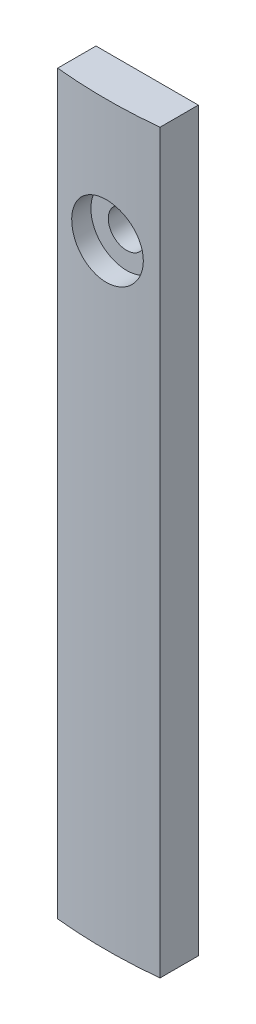
ISO-10303-21;
HEADER;
FILE_DESCRIPTION(('STEP AP214'),'2;1');
FILE_NAME('part.step','',(''),(''),'','','');
FILE_SCHEMA(('AUTOMOTIVE_DESIGN { 1 0 10303 214 1 1 1 1 }'));
ENDSEC;
DATA;
#1=APPLICATION_CONTEXT('core data for automotive mechanical design processes');
#2=APPLICATION_PROTOCOL_DEFINITION('international standard','automotive_design',2000,#1);
#3=PRODUCT_CONTEXT('',#1,'mechanical');
#4=PRODUCT('Part','Part','',(#3));
#5=PRODUCT_RELATED_PRODUCT_CATEGORY('part','',(#4));
#6=PRODUCT_DEFINITION_FORMATION('','',#4);
#7=PRODUCT_DEFINITION_CONTEXT('part definition',#1,'design');
#8=PRODUCT_DEFINITION('design','',#6,#7);
#9=PRODUCT_DEFINITION_SHAPE('','',#8);
#10=(LENGTH_UNIT() NAMED_UNIT(*) SI_UNIT(.MILLI.,.METRE.));
#11=(NAMED_UNIT(*) PLANE_ANGLE_UNIT() SI_UNIT($,.RADIAN.));
#12=(NAMED_UNIT(*) SI_UNIT($,.STERADIAN.) SOLID_ANGLE_UNIT());
#13=UNCERTAINTY_MEASURE_WITH_UNIT(LENGTH_MEASURE(1.E-05),#10,'distance_accuracy_value','');
#14=(GEOMETRIC_REPRESENTATION_CONTEXT(3) GLOBAL_UNCERTAINTY_ASSIGNED_CONTEXT((#13)) GLOBAL_UNIT_ASSIGNED_CONTEXT((#10,
#11,#12)) REPRESENTATION_CONTEXT('',''));
#15=CARTESIAN_POINT('',(0.,0.,0.));
#16=DIRECTION('',(0.,0.,1.));
#17=DIRECTION('',(1.,0.,0.));
#18=AXIS2_PLACEMENT_3D('',#15,#16,#17);
#19=CARTESIAN_POINT('',(1130.,0.,-47.2500000000012));
#20=DIRECTION('',(0.,1.,0.));
#21=DIRECTION('',(0.,0.,1.));
#22=AXIS2_PLACEMENT_3D('',#19,#20,#21);
#23=CYLINDRICAL_SURFACE('',#22,49.0000000000012);
#24=CARTESIAN_POINT('',(1133.5,60.,1.62484015319128));
#25=CARTESIAN_POINT('',(1133.49999138471,60.1963272981338,1.62484182137785));
#26=CARTESIAN_POINT('',(1133.48342543175,60.3927905657283,1.62603583248146));
#27=CARTESIAN_POINT('',(1133.41758080015,60.7802879194948,1.63068318601812));
#28=CARTESIAN_POINT('',(1133.36826444278,60.9713154877029,1.63413913069808));
#29=CARTESIAN_POINT('',(1133.23834662768,61.3422726762905,1.6429169212688));
#30=CARTESIAN_POINT('',(1133.15776216493,61.5222082639679,1.6482377533963));
#31=CARTESIAN_POINT('',(1132.96762424764,61.8659536706861,1.66014451173063));
#32=CARTESIAN_POINT('',(1132.85807725288,62.0297670744391,1.66673015574537));
#33=CARTESIAN_POINT('',(1132.61289481016,62.3369782569502,1.68043875872502));
#34=CARTESIAN_POINT('',(1132.47721533675,62.4803408625134,1.68756261192616));
#35=CARTESIAN_POINT('',(1132.18371140959,62.7422793482111,1.70153668874623));
#36=CARTESIAN_POINT('',(1132.02588601558,62.8608541753853,1.70838690073115));
#37=CARTESIAN_POINT('',(1131.69236652607,63.0699634813328,1.72104992996714));
#38=CARTESIAN_POINT('',(1131.51665375187,63.1604682409198,1.72686164496973));
#39=CARTESIAN_POINT('',(1131.15247804581,63.3106781371717,1.73678332322877));
#40=CARTESIAN_POINT('',(1130.96401528453,63.3703836858107,1.74089330924763));
#41=CARTESIAN_POINT('',(1130.58003354288,63.4572010506706,1.7469422286151));
#42=CARTESIAN_POINT('',(1130.38452727195,63.4843688153932,1.74888488827177));
#43=CARTESIAN_POINT('',(1129.99172053506,63.5055122699863,1.75039285186304));
#44=CARTESIAN_POINT('',(1129.79442009453,63.4994884298072,1.74995818945746));
#45=CARTESIAN_POINT('',(1129.40400476744,63.4544656556978,1.74676357907627));
#46=CARTESIAN_POINT('',(1129.21088290211,63.415526895311,1.74400787435641));
#47=CARTESIAN_POINT('',(1128.8339233455,63.3058730623361,1.73648619153198));
#48=CARTESIAN_POINT('',(1128.65008572245,63.2351577562742,1.7317201986571));
#49=CARTESIAN_POINT('',(1128.29672061085,63.0638904628194,1.72070707359548));
#50=CARTESIAN_POINT('',(1128.12720632169,62.9633113320668,1.71445859501374));
#51=CARTESIAN_POINT('',(1127.80744387363,62.7351911875116,1.70118331671056));
#52=CARTESIAN_POINT('',(1127.65719600015,62.6076497743562,1.69415650546156));
#53=CARTESIAN_POINT('',(1127.37987991614,62.3288859267673,1.68009641551995));
#54=CARTESIAN_POINT('',(1127.2528642227,62.1776112410918,1.67306315743131));
#55=CARTESIAN_POINT('',(1127.02602324215,61.8558576580262,1.65979876226108));
#56=CARTESIAN_POINT('',(1126.92619796979,61.6853787502146,1.65356762561479));
#57=CARTESIAN_POINT('',(1126.75657455728,61.330021232426,1.64261142582452));
#58=CARTESIAN_POINT('',(1126.68677883107,61.145141466238,1.63788648376476));
#59=CARTESIAN_POINT('',(1126.57923304255,60.766246488547,1.6304795861051));
#60=CARTESIAN_POINT('',(1126.54148248696,60.5722314177148,1.62779759905751));
#61=CARTESIAN_POINT('',(1126.49916448243,60.1810318713065,1.62478500291623));
#62=CARTESIAN_POINT('',(1126.49452393971,59.9838553408108,1.62444921438126));
#63=CARTESIAN_POINT('',(1126.51836651834,59.5915268912336,1.62615334291338));
#64=CARTESIAN_POINT('',(1126.54684941371,59.3963749583491,1.62819324377316));
#65=CARTESIAN_POINT('',(1126.63606954019,59.0138432795309,1.63441415833606));
#66=CARTESIAN_POINT('',(1126.69677293161,58.8264556013451,1.63859292552313));
#67=CARTESIAN_POINT('',(1126.84867658092,58.4645264945571,1.64861880511902));
#68=CARTESIAN_POINT('',(1126.93987719968,58.2899852179993,1.65446593726987));
#69=CARTESIAN_POINT('',(1127.15037252077,57.9583682433128,1.6671822369456));
#70=CARTESIAN_POINT('',(1127.26971609433,57.8013236352936,1.6740531746166));
#71=CARTESIAN_POINT('',(1127.53303868746,57.5094715129454,1.68803673853706));
#72=CARTESIAN_POINT('',(1127.67701801989,57.3746642810516,1.69514936785485));
#73=CARTESIAN_POINT('',(1127.98584017918,57.1308656696375,1.70883012690909));
#74=CARTESIAN_POINT('',(1128.15072045703,57.0219216650312,1.71539724332087));
#75=CARTESIAN_POINT('',(1128.49647652521,56.8332665458164,1.72723245354702));
#76=CARTESIAN_POINT('',(1128.67735219254,56.7535552064244,1.73250055735));
#77=CARTESIAN_POINT('',(1129.04979221687,56.6257101289246,1.74113940539465));
#78=CARTESIAN_POINT('',(1129.2413463319,56.5775466791577,1.74451193445387));
#79=CARTESIAN_POINT('',(1129.62984735937,56.514067379293,1.74898681071545));
#80=CARTESIAN_POINT('',(1129.82679419945,56.4987510886348,1.75008918836606));
#81=CARTESIAN_POINT('',(1130.22002197211,56.5014054535053,1.74989963013785));
#82=CARTESIAN_POINT('',(1130.41630341114,56.5193020935616,1.74861301815187));
#83=CARTESIAN_POINT('',(1130.80306620334,56.5877204842139,1.74380065630042));
#84=CARTESIAN_POINT('',(1130.9935475471,56.6382422877088,1.74027490280439));
#85=CARTESIAN_POINT('',(1131.36331152796,56.7704592590041,1.73138025979301));
#86=CARTESIAN_POINT('',(1131.54259443333,56.8521536796674,1.7260114144527));
#87=CARTESIAN_POINT('',(1131.88491065376,57.044387556813,1.71403253538291));
#88=CARTESIAN_POINT('',(1132.04794432503,57.1549263807741,1.70742252887141));
#89=CARTESIAN_POINT('',(1132.35351148414,57.4019874599349,1.69368669390207));
#90=CARTESIAN_POINT('',(1132.49600109952,57.5385639170239,1.68655980899379));
#91=CARTESIAN_POINT('',(1132.7560844209,57.8337371206836,1.67260224399991));
#92=CARTESIAN_POINT('',(1132.87367205161,57.9923392252161,1.66577163651898));
#93=CARTESIAN_POINT('',(1133.08072849529,58.3272920079036,1.6531688313562));
#94=CARTESIAN_POINT('',(1133.17015525854,58.503668713553,1.64739822176307));
#95=CARTESIAN_POINT('',(1133.31801400921,58.8688496589503,1.63758866145154));
#96=CARTESIAN_POINT('',(1133.3764820364,59.0576391594536,1.63354769826717));
#97=CARTESIAN_POINT('',(1133.44568695417,59.3729731878345,1.62870625304527));
#98=CARTESIAN_POINT('',(1133.46602772074,59.4974832271809,1.62726301695002));
#99=CARTESIAN_POINT('',(1133.4931869964,59.747976833039,1.62532943244076));
#100=CARTESIAN_POINT('',(1133.50000553091,59.8739603967826,1.62483908223694));
#101=CARTESIAN_POINT('',(1133.5,60.,1.62484015319128));
#102=B_SPLINE_CURVE_WITH_KNOTS('',3,(#24,#25,#26,#27,#28,#29,#30,#31,#32,#33,#34,#35,#36,#37,
#38,#39,#40,#41,#42,#43,#44,#45,#46,#47,#48,#49,#50,#51,#52,#53,#54,#55,#56,#57,#58,#59,#60,#61,
#62,#63,#64,#65,#66,#67,#68,#69,#70,#71,#72,#73,#74,#75,#76,#77,#78,#79,#80,#81,#82,#83,#84,#85,
#86,#87,#88,#89,#90,#91,#92,#93,#94,#95,#96,#97,#98,#99,#100,#101),.UNSPECIFIED.,.T.,.F.,(4,2,2,
2,2,2,2,2,2,2,2,2,2,2,2,2,2,2,2,2,2,2,2,2,2,2,2,2,2,2,2,2,2,2,2,2,2,2,4),(0.,0.588521744076995,
1.17772174733948,1.76660195368694,2.35535092732206,2.94510058365053,3.53487528687402,
4.12527229918089,4.7156614140601,5.30503389458867,5.8943980303827,6.48268704219386,
7.0709803764495,7.65981005844319,8.24864846251611,8.83880193331597,9.42895572437591,
10.019156946431,10.6093490831974,11.1982379056584,11.7871227106565,12.3753902575052,
12.9636647657076,13.5529684553689,14.1422796291548,14.732662084177,15.3230399993808,
15.9128610968317,16.5026742832958,17.0911746410666,17.6796759530409,18.2681631608567,
18.856637464979,19.4463504283392,20.0362070974564,20.6269404075644,21.216984511027,
21.5948086197467,21.9726320188021),.UNSPECIFIED.);
#103=CARTESIAN_POINT('',(1133.5,60.,1.62484015319128));
#104=VERTEX_POINT('',#103);
#105=EDGE_CURVE('E11',#104,#104,#102,.T.);
#106=ORIENTED_EDGE('',*,*,#105,.F.);
#107=EDGE_LOOP('',(#106));
#108=FACE_BOUND('',#107,.T.);
#109=CARTESIAN_POINT('',(1130.,72.,-47.2500000000012));
#110=DIRECTION('',(0.,1.,0.));
#111=DIRECTION('',(0.,0.,1.));
#112=AXIS2_PLACEMENT_3D('',#109,#110,#111);
#113=CIRCLE('',#112,49.0000000000012);
#114=CARTESIAN_POINT('',(1125.,72.,1.49423042781576));
#115=VERTEX_POINT('',#114);
#116=CARTESIAN_POINT('',(1135.,72.,1.49423042781574));
#117=VERTEX_POINT('',#116);
#118=EDGE_CURVE('E104',#115,#117,#113,.T.);
#119=ORIENTED_EDGE('',*,*,#118,.F.);
#120=DIRECTION('',(0.,1.,0.));
#121=VECTOR('',#120,1.);
#122=CARTESIAN_POINT('',(1125.,0.,1.49423042781576));
#123=LINE('',#122,#121);
#124=CARTESIAN_POINT('',(1125.,0.,1.49423042781576));
#125=VERTEX_POINT('',#124);
#126=EDGE_CURVE('E45',#125,#115,#123,.T.);
#127=ORIENTED_EDGE('',*,*,#126,.F.);
#128=CARTESIAN_POINT('',(1130.,0.,-47.2500000000012));
#129=DIRECTION('',(0.,1.,0.));
#130=DIRECTION('',(0.,0.,1.));
#131=AXIS2_PLACEMENT_3D('',#128,#129,#130);
#132=CIRCLE('',#131,49.0000000000012);
#133=CARTESIAN_POINT('',(1135.,0.,1.49423042781574));
#134=VERTEX_POINT('',#133);
#135=EDGE_CURVE('E97',#125,#134,#132,.T.);
#136=ORIENTED_EDGE('',*,*,#135,.T.);
#137=DIRECTION('',(0.,1.,0.));
#138=VECTOR('',#137,1.);
#139=CARTESIAN_POINT('',(1135.,0.,1.49423042781574));
#140=LINE('',#139,#138);
#141=EDGE_CURVE('E80',#134,#117,#140,.T.);
#142=ORIENTED_EDGE('',*,*,#141,.T.);
#143=EDGE_LOOP('',(#119,#127,#136,#142));
#144=FACE_BOUND('',#143,.T.);
#145=ADVANCED_FACE('F33',(#108,#144),#23,.T.);
#146=CARTESIAN_POINT('',(1125.,0.,-2.2500000000001));
#147=DIRECTION('',(-1.,0.,0.));
#148=DIRECTION('',(0.,0.,1.));
#149=AXIS2_PLACEMENT_3D('',#146,#147,#148);
#150=PLANE('',#149);
#151=DIRECTION('',(0.,0.,1.));
#152=VECTOR('',#151,1.);
#153=CARTESIAN_POINT('',(1125.,72.,-2.2500000000001));
#154=LINE('',#153,#152);
#155=CARTESIAN_POINT('',(1125.,72.,-2.2500000000001));
#156=VERTEX_POINT('',#155);
#157=EDGE_CURVE('E99',#156,#115,#154,.T.);
#158=ORIENTED_EDGE('',*,*,#157,.F.);
#159=DIRECTION('',(0.,1.,0.));
#160=VECTOR('',#159,1.);
#161=CARTESIAN_POINT('',(1125.,0.,-2.2500000000001));
#162=LINE('',#161,#160);
#163=CARTESIAN_POINT('',(1125.,0.,-2.2500000000001));
#164=VERTEX_POINT('',#163);
#165=EDGE_CURVE('E69',#164,#156,#162,.T.);
#166=ORIENTED_EDGE('',*,*,#165,.F.);
#167=DIRECTION('',(0.,0.,1.));
#168=VECTOR('',#167,1.);
#169=CARTESIAN_POINT('',(1125.,0.,-2.2500000000001));
#170=LINE('',#169,#168);
#171=EDGE_CURVE('E94',#164,#125,#170,.T.);
#172=ORIENTED_EDGE('',*,*,#171,.T.);
#173=ORIENTED_EDGE('',*,*,#126,.T.);
#174=EDGE_LOOP('',(#158,#166,#172,#173));
#175=FACE_BOUND('',#174,.T.);
#176=ADVANCED_FACE('F116',(#175),#150,.T.);
#177=CARTESIAN_POINT('',(1135.,0.,-2.2500000000001));
#178=DIRECTION('',(0.,0.,-1.));
#179=DIRECTION('',(-1.,0.,0.));
#180=AXIS2_PLACEMENT_3D('',#177,#178,#179);
#181=PLANE('',#180);
#182=CARTESIAN_POINT('',(1130.,60.,-2.2500000000001));
#183=DIRECTION('',(0.,0.,1.));
#184=DIRECTION('',(1.,0.,0.));
#185=AXIS2_PLACEMENT_3D('',#182,#183,#184);
#186=CIRCLE('',#185,1.80000000000002);
#187=CARTESIAN_POINT('',(1131.8,60.,-2.2500000000001));
#188=VERTEX_POINT('',#187);
#189=EDGE_CURVE('E108',#188,#188,#186,.T.);
#190=ORIENTED_EDGE('',*,*,#189,.T.);
#191=EDGE_LOOP('',(#190));
#192=FACE_BOUND('',#191,.T.);
#193=DIRECTION('',(-1.,0.,0.));
#194=VECTOR('',#193,1.);
#195=CARTESIAN_POINT('',(1135.,72.,-2.2500000000001));
#196=LINE('',#195,#194);
#197=CARTESIAN_POINT('',(1135.,72.,-2.2500000000001));
#198=VERTEX_POINT('',#197);
#199=EDGE_CURVE('E88',#198,#156,#196,.T.);
#200=ORIENTED_EDGE('',*,*,#199,.F.);
#201=DIRECTION('',(0.,1.,0.));
#202=VECTOR('',#201,1.);
#203=CARTESIAN_POINT('',(1135.,0.,-2.2500000000001));
#204=LINE('',#203,#202);
#205=CARTESIAN_POINT('',(1135.,0.,-2.2500000000001));
#206=VERTEX_POINT('',#205);
#207=EDGE_CURVE('E83',#206,#198,#204,.T.);
#208=ORIENTED_EDGE('',*,*,#207,.F.);
#209=DIRECTION('',(-1.,0.,0.));
#210=VECTOR('',#209,1.);
#211=CARTESIAN_POINT('',(1135.,0.,-2.2500000000001));
#212=LINE('',#211,#210);
#213=EDGE_CURVE('E86',#206,#164,#212,.T.);
#214=ORIENTED_EDGE('',*,*,#213,.T.);
#215=ORIENTED_EDGE('',*,*,#165,.T.);
#216=EDGE_LOOP('',(#200,#208,#214,#215));
#217=FACE_BOUND('',#216,.T.);
#218=ADVANCED_FACE('F85',(#192,#217),#181,.T.);
#219=CARTESIAN_POINT('',(1135.,0.,1.49423042781574));
#220=DIRECTION('',(1.,0.,0.));
#221=DIRECTION('',(0.,0.,-1.));
#222=AXIS2_PLACEMENT_3D('',#219,#220,#221);
#223=PLANE('',#222);
#224=DIRECTION('',(0.,0.,-1.));
#225=VECTOR('',#224,1.);
#226=CARTESIAN_POINT('',(1135.,72.,1.49423042781574));
#227=LINE('',#226,#225);
#228=EDGE_CURVE('E107',#117,#198,#227,.T.);
#229=ORIENTED_EDGE('',*,*,#228,.F.);
#230=ORIENTED_EDGE('',*,*,#141,.F.);
#231=DIRECTION('',(0.,0.,-1.));
#232=VECTOR('',#231,1.);
#233=CARTESIAN_POINT('',(1135.,0.,1.49423042781574));
#234=LINE('',#233,#232);
#235=EDGE_CURVE('E93',#134,#206,#234,.T.);
#236=ORIENTED_EDGE('',*,*,#235,.T.);
#237=ORIENTED_EDGE('',*,*,#207,.T.);
#238=EDGE_LOOP('',(#229,#230,#236,#237));
#239=FACE_BOUND('',#238,.T.);
#240=ADVANCED_FACE('F96',(#239),#223,.T.);
#241=CARTESIAN_POINT('',(1130.,0.,-47.2500000000012));
#242=DIRECTION('',(0.,1.,0.));
#243=DIRECTION('',(0.,0.,1.));
#244=AXIS2_PLACEMENT_3D('',#241,#242,#243);
#245=PLANE('',#244);
#246=ORIENTED_EDGE('',*,*,#135,.F.);
#247=ORIENTED_EDGE('',*,*,#171,.F.);
#248=ORIENTED_EDGE('',*,*,#213,.F.);
#249=ORIENTED_EDGE('',*,*,#235,.F.);
#250=EDGE_LOOP('',(#246,#247,#248,#249));
#251=FACE_BOUND('',#250,.T.);
#252=ADVANCED_FACE('F92',(#251),#245,.F.);
#253=CARTESIAN_POINT('',(1130.,72.,-47.2500000000012));
#254=DIRECTION('',(0.,1.,0.));
#255=DIRECTION('',(0.,0.,1.));
#256=AXIS2_PLACEMENT_3D('',#253,#254,#255);
#257=PLANE('',#256);
#258=ORIENTED_EDGE('',*,*,#118,.T.);
#259=ORIENTED_EDGE('',*,*,#228,.T.);
#260=ORIENTED_EDGE('',*,*,#199,.T.);
#261=ORIENTED_EDGE('',*,*,#157,.T.);
#262=EDGE_LOOP('',(#258,#259,#260,#261));
#263=FACE_BOUND('',#262,.T.);
#264=ADVANCED_FACE('F115',(#263),#257,.T.);
#265=CARTESIAN_POINT('',(1130.,60.,1.74999999999999));
#266=DIRECTION('',(0.,0.,1.));
#267=DIRECTION('',(1.,0.,0.));
#268=AXIS2_PLACEMENT_3D('',#265,#266,#267);
#269=CYLINDRICAL_SURFACE('',#268,1.80000000000002);
#270=ORIENTED_EDGE('',*,*,#189,.F.);
#271=EDGE_LOOP('',(#270));
#272=FACE_BOUND('',#271,.T.);
#273=CARTESIAN_POINT('',(1130.,60.,-0.250000000000115));
#274=DIRECTION('',(0.,0.,1.));
#275=DIRECTION('',(1.,0.,0.));
#276=AXIS2_PLACEMENT_3D('',#273,#274,#275);
#277=CIRCLE('',#276,1.80000000000002);
#278=CARTESIAN_POINT('',(1131.8,60.,-0.250000000000115));
#279=VERTEX_POINT('',#278);
#280=EDGE_CURVE('E155',#279,#279,#277,.T.);
#281=ORIENTED_EDGE('',*,*,#280,.T.);
#282=EDGE_LOOP('',(#281));
#283=FACE_BOUND('',#282,.T.);
#284=ADVANCED_FACE('F135',(#272,#283),#269,.F.);
#285=CARTESIAN_POINT('',(1131.8,60.,-0.250000000000115));
#286=DIRECTION('',(0.,0.,-1.));
#287=DIRECTION('',(-1.,0.,0.));
#288=AXIS2_PLACEMENT_3D('',#285,#286,#287);
#289=PLANE('',#288);
#290=ORIENTED_EDGE('',*,*,#280,.F.);
#291=EDGE_LOOP('',(#290));
#292=FACE_BOUND('',#291,.T.);
#293=CARTESIAN_POINT('',(1130.,60.,-0.250000000000115));
#294=DIRECTION('',(0.,0.,1.));
#295=DIRECTION('',(1.,0.,0.));
#296=AXIS2_PLACEMENT_3D('',#293,#294,#295);
#297=CIRCLE('',#296,3.50000000000006);
#298=CARTESIAN_POINT('',(1133.5,60.,-0.250000000000115));
#299=VERTEX_POINT('',#298);
#300=EDGE_CURVE('E153',#299,#299,#297,.T.);
#301=ORIENTED_EDGE('',*,*,#300,.T.);
#302=EDGE_LOOP('',(#301));
#303=FACE_BOUND('',#302,.T.);
#304=ADVANCED_FACE('F139',(#292,#303),#289,.F.);
#305=CARTESIAN_POINT('',(1130.,60.,1.74999999999999));
#306=DIRECTION('',(0.,0.,1.));
#307=DIRECTION('',(1.,0.,0.));
#308=AXIS2_PLACEMENT_3D('',#305,#306,#307);
#309=CYLINDRICAL_SURFACE('',#308,3.50000000000006);
#310=ORIENTED_EDGE('',*,*,#105,.T.);
#311=EDGE_LOOP('',(#310));
#312=FACE_BOUND('',#311,.T.);
#313=ORIENTED_EDGE('',*,*,#300,.F.);
#314=EDGE_LOOP('',(#313));
#315=FACE_BOUND('',#314,.T.);
#316=ADVANCED_FACE('F142',(#312,#315),#309,.F.);
#317=CLOSED_SHELL('',(#145,#176,#218,#240,#252,#264,#284,#304,#316));
#318=MANIFOLD_SOLID_BREP('B2',#317);
#319=ADVANCED_BREP_SHAPE_REPRESENTATION('',(#18,#318),#14);
#320=SHAPE_DEFINITION_REPRESENTATION(#9,#319);
ENDSEC;
END-ISO-10303-21;
